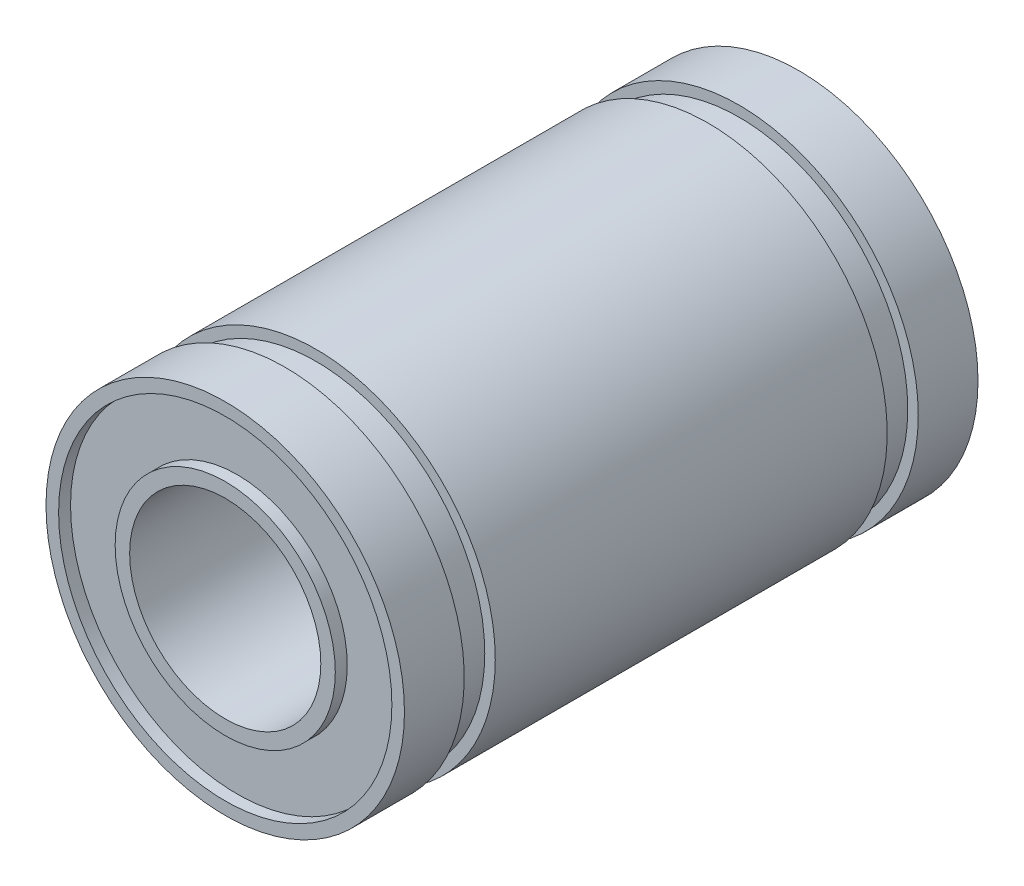
ISO-10303-21;
HEADER;
FILE_DESCRIPTION(('STEP AP214'),'2;1');
FILE_NAME('part.step','',(''),(''),'','','');
FILE_SCHEMA(('AUTOMOTIVE_DESIGN { 1 0 10303 214 1 1 1 1 }'));
ENDSEC;
DATA;
#1=APPLICATION_CONTEXT('core data for automotive mechanical design processes');
#2=APPLICATION_PROTOCOL_DEFINITION('international standard','automotive_design',2000,#1);
#3=PRODUCT_CONTEXT('',#1,'mechanical');
#4=PRODUCT('Part','Part','',(#3));
#5=PRODUCT_RELATED_PRODUCT_CATEGORY('part','',(#4));
#6=PRODUCT_DEFINITION_FORMATION('','',#4);
#7=PRODUCT_DEFINITION_CONTEXT('part definition',#1,'design');
#8=PRODUCT_DEFINITION('design','',#6,#7);
#9=PRODUCT_DEFINITION_SHAPE('','',#8);
#10=(LENGTH_UNIT() NAMED_UNIT(*) SI_UNIT(.MILLI.,.METRE.));
#11=(NAMED_UNIT(*) PLANE_ANGLE_UNIT() SI_UNIT($,.RADIAN.));
#12=(NAMED_UNIT(*) SI_UNIT($,.STERADIAN.) SOLID_ANGLE_UNIT());
#13=UNCERTAINTY_MEASURE_WITH_UNIT(LENGTH_MEASURE(1.E-05),#10,'distance_accuracy_value','');
#14=(GEOMETRIC_REPRESENTATION_CONTEXT(3) GLOBAL_UNCERTAINTY_ASSIGNED_CONTEXT((#13)) GLOBAL_UNIT_ASSIGNED_CONTEXT((#10,
#11,#12)) REPRESENTATION_CONTEXT('',''));
#15=CARTESIAN_POINT('',(0.,0.,0.));
#16=DIRECTION('',(0.,0.,1.));
#17=DIRECTION('',(1.,0.,0.));
#18=AXIS2_PLACEMENT_3D('',#15,#16,#17);
#19=CARTESIAN_POINT('',(0.,0.,12.));
#20=DIRECTION('',(0.,0.,1.));
#21=DIRECTION('',(1.,0.,0.));
#22=AXIS2_PLACEMENT_3D('',#19,#20,#21);
#23=PLANE('',#22);
#24=CARTESIAN_POINT('',(0.,0.,12.));
#25=DIRECTION('',(0.,0.,1.));
#26=DIRECTION('',(1.,0.,0.));
#27=AXIS2_PLACEMENT_3D('',#24,#25,#26);
#28=CIRCLE('',#27,4.);
#29=CARTESIAN_POINT('',(4.,0.,12.));
#30=VERTEX_POINT('',#29);
#31=EDGE_CURVE('E47',#30,#30,#28,.T.);
#32=ORIENTED_EDGE('',*,*,#31,.F.);
#33=EDGE_LOOP('',(#32));
#34=FACE_BOUND('',#33,.T.);
#35=CARTESIAN_POINT('',(0.,0.,12.));
#36=DIRECTION('',(0.,0.,-1.));
#37=DIRECTION('',(-1.,0.,0.));
#38=AXIS2_PLACEMENT_3D('',#35,#36,#37);
#39=CIRCLE('',#38,4.60638309141382);
#40=CARTESIAN_POINT('',(-4.60638309141382,0.,12.));
#41=VERTEX_POINT('',#40);
#42=EDGE_CURVE('E128',#41,#41,#39,.T.);
#43=ORIENTED_EDGE('',*,*,#42,.F.);
#44=EDGE_LOOP('',(#43));
#45=FACE_BOUND('',#44,.T.);
#46=ADVANCED_FACE('F34',(#34,#45),#23,.T.);
#47=CARTESIAN_POINT('',(0.,0.,-12.));
#48=DIRECTION('',(0.,0.,1.));
#49=DIRECTION('',(1.,0.,0.));
#50=AXIS2_PLACEMENT_3D('',#47,#48,#49);
#51=PLANE('',#50);
#52=CARTESIAN_POINT('',(0.,0.,-12.));
#53=DIRECTION('',(0.,0.,1.));
#54=DIRECTION('',(1.,0.,0.));
#55=AXIS2_PLACEMENT_3D('',#52,#53,#54);
#56=CIRCLE('',#55,4.);
#57=CARTESIAN_POINT('',(4.,0.,-12.));
#58=VERTEX_POINT('',#57);
#59=EDGE_CURVE('E50',#58,#58,#56,.T.);
#60=ORIENTED_EDGE('',*,*,#59,.T.);
#61=EDGE_LOOP('',(#60));
#62=FACE_BOUND('',#61,.T.);
#63=CARTESIAN_POINT('',(0.,0.,-12.));
#64=DIRECTION('',(0.,0.,-1.));
#65=DIRECTION('',(-1.,0.,0.));
#66=AXIS2_PLACEMENT_3D('',#63,#64,#65);
#67=CIRCLE('',#66,4.60638309141382);
#68=CARTESIAN_POINT('',(-4.60638309141382,0.,-12.));
#69=VERTEX_POINT('',#68);
#70=EDGE_CURVE('E125',#69,#69,#67,.T.);
#71=ORIENTED_EDGE('',*,*,#70,.T.);
#72=EDGE_LOOP('',(#71));
#73=FACE_BOUND('',#72,.T.);
#74=ADVANCED_FACE('F85',(#62,#73),#51,.F.);
#75=CARTESIAN_POINT('',(0.,0.,12.));
#76=DIRECTION('',(0.,0.,-1.));
#77=DIRECTION('',(-1.,0.,0.));
#78=AXIS2_PLACEMENT_3D('',#75,#76,#77);
#79=CYLINDRICAL_SURFACE('',#78,7.5);
#80=CARTESIAN_POINT('',(0.,0.,12.));
#81=DIRECTION('',(0.,0.,1.));
#82=DIRECTION('',(1.,0.,0.));
#83=AXIS2_PLACEMENT_3D('',#80,#81,#82);
#84=CIRCLE('',#83,7.5);
#85=CARTESIAN_POINT('',(7.5,0.,12.));
#86=VERTEX_POINT('',#85);
#87=EDGE_CURVE('E10',#86,#86,#84,.T.);
#88=ORIENTED_EDGE('',*,*,#87,.F.);
#89=EDGE_LOOP('',(#88));
#90=FACE_BOUND('',#89,.T.);
#91=CARTESIAN_POINT('',(0.,0.,9.5));
#92=DIRECTION('',(0.,0.,-1.));
#93=DIRECTION('',(-1.,0.,0.));
#94=AXIS2_PLACEMENT_3D('',#91,#92,#93);
#95=CIRCLE('',#94,7.5);
#96=CARTESIAN_POINT('',(-7.5,0.,9.5));
#97=VERTEX_POINT('',#96);
#98=EDGE_CURVE('E38',#97,#97,#95,.T.);
#99=ORIENTED_EDGE('',*,*,#98,.F.);
#100=EDGE_LOOP('',(#99));
#101=FACE_BOUND('',#100,.T.);
#102=ADVANCED_FACE('F36',(#90,#101),#79,.T.);
#103=CARTESIAN_POINT('',(0.,0.,-8.2));
#104=DIRECTION('',(0.,0.,-1.));
#105=DIRECTION('',(-1.,0.,0.));
#106=AXIS2_PLACEMENT_3D('',#103,#104,#105);
#107=CIRCLE('',#106,7.5);
#108=CARTESIAN_POINT('',(-7.5,0.,-8.2));
#109=VERTEX_POINT('',#108);
#110=EDGE_CURVE('E56',#109,#109,#107,.T.);
#111=ORIENTED_EDGE('',*,*,#110,.F.);
#112=EDGE_LOOP('',(#111));
#113=FACE_BOUND('',#112,.T.);
#114=CARTESIAN_POINT('',(0.,0.,8.2));
#115=DIRECTION('',(0.,0.,1.));
#116=DIRECTION('',(1.,0.,0.));
#117=AXIS2_PLACEMENT_3D('',#114,#115,#116);
#118=CIRCLE('',#117,7.5);
#119=CARTESIAN_POINT('',(7.5,0.,8.2));
#120=VERTEX_POINT('',#119);
#121=EDGE_CURVE('E59',#120,#120,#118,.T.);
#122=ORIENTED_EDGE('',*,*,#121,.F.);
#123=EDGE_LOOP('',(#122));
#124=FACE_BOUND('',#123,.T.);
#125=ADVANCED_FACE('F115',(#113,#124),#79,.T.);
#126=CARTESIAN_POINT('',(0.,0.,-12.));
#127=DIRECTION('',(0.,0.,1.));
#128=DIRECTION('',(1.,0.,0.));
#129=AXIS2_PLACEMENT_3D('',#126,#127,#128);
#130=CIRCLE('',#129,7.5);
#131=CARTESIAN_POINT('',(7.5,0.,-12.));
#132=VERTEX_POINT('',#131);
#133=EDGE_CURVE('E42',#132,#132,#130,.T.);
#134=ORIENTED_EDGE('',*,*,#133,.T.);
#135=EDGE_LOOP('',(#134));
#136=FACE_BOUND('',#135,.T.);
#137=CARTESIAN_POINT('',(0.,0.,-9.5));
#138=DIRECTION('',(0.,0.,1.));
#139=DIRECTION('',(1.,0.,0.));
#140=AXIS2_PLACEMENT_3D('',#137,#138,#139);
#141=CIRCLE('',#140,7.5);
#142=CARTESIAN_POINT('',(7.5,0.,-9.5));
#143=VERTEX_POINT('',#142);
#144=EDGE_CURVE('E53',#143,#143,#141,.T.);
#145=ORIENTED_EDGE('',*,*,#144,.F.);
#146=EDGE_LOOP('',(#145));
#147=FACE_BOUND('',#146,.T.);
#148=ADVANCED_FACE('F110',(#136,#147),#79,.T.);
#149=CARTESIAN_POINT('',(0.,0.,12.));
#150=DIRECTION('',(0.,0.,-1.));
#151=DIRECTION('',(-1.,0.,0.));
#152=AXIS2_PLACEMENT_3D('',#149,#150,#151);
#153=CIRCLE('',#152,6.97294129068912);
#154=CARTESIAN_POINT('',(-6.97294129068912,0.,12.));
#155=VERTEX_POINT('',#154);
#156=EDGE_CURVE('E119',#155,#155,#153,.T.);
#157=ORIENTED_EDGE('',*,*,#156,.T.);
#158=EDGE_LOOP('',(#157));
#159=FACE_BOUND('',#158,.T.);
#160=ORIENTED_EDGE('',*,*,#87,.T.);
#161=EDGE_LOOP('',(#160));
#162=FACE_BOUND('',#161,.T.);
#163=ADVANCED_FACE('F100',(#159,#162),#23,.T.);
#164=CARTESIAN_POINT('',(0.,0.,-12.));
#165=DIRECTION('',(0.,0.,-1.));
#166=DIRECTION('',(-1.,0.,0.));
#167=AXIS2_PLACEMENT_3D('',#164,#165,#166);
#168=CIRCLE('',#167,6.97294129068912);
#169=CARTESIAN_POINT('',(-6.97294129068912,0.,-12.));
#170=VERTEX_POINT('',#169);
#171=EDGE_CURVE('E135',#170,#170,#168,.T.);
#172=ORIENTED_EDGE('',*,*,#171,.F.);
#173=EDGE_LOOP('',(#172));
#174=FACE_BOUND('',#173,.T.);
#175=ORIENTED_EDGE('',*,*,#133,.F.);
#176=EDGE_LOOP('',(#175));
#177=FACE_BOUND('',#176,.T.);
#178=ADVANCED_FACE('F91',(#174,#177),#51,.F.);
#179=CARTESIAN_POINT('',(0.,0.,12.));
#180=DIRECTION('',(0.,0.,-1.));
#181=DIRECTION('',(-1.,0.,0.));
#182=AXIS2_PLACEMENT_3D('',#179,#180,#181);
#183=CYLINDRICAL_SURFACE('',#182,4.);
#184=ORIENTED_EDGE('',*,*,#31,.T.);
#185=EDGE_LOOP('',(#184));
#186=FACE_BOUND('',#185,.T.);
#187=ORIENTED_EDGE('',*,*,#59,.F.);
#188=EDGE_LOOP('',(#187));
#189=FACE_BOUND('',#188,.T.);
#190=ADVANCED_FACE('F88',(#186,#189),#183,.F.);
#191=CARTESIAN_POINT('',(7.99457965207147,0.,-8.2));
#192=DIRECTION('',(0.,0.,-1.));
#193=DIRECTION('',(-1.,0.,0.));
#194=AXIS2_PLACEMENT_3D('',#191,#192,#193);
#195=PLANE('',#194);
#196=CARTESIAN_POINT('',(0.,0.,-8.2));
#197=DIRECTION('',(0.,0.,-1.));
#198=DIRECTION('',(-1.,0.,0.));
#199=AXIS2_PLACEMENT_3D('',#196,#197,#198);
#200=CIRCLE('',#199,7.06045407366765);
#201=CARTESIAN_POINT('',(-7.06045407366765,0.,-8.2));
#202=VERTEX_POINT('',#201);
#203=EDGE_CURVE('E57',#202,#202,#200,.T.);
#204=ORIENTED_EDGE('',*,*,#203,.F.);
#205=EDGE_LOOP('',(#204));
#206=FACE_BOUND('',#205,.T.);
#207=ORIENTED_EDGE('',*,*,#110,.T.);
#208=EDGE_LOOP('',(#207));
#209=FACE_BOUND('',#208,.T.);
#210=ADVANCED_FACE('F90',(#206,#209),#195,.T.);
#211=CARTESIAN_POINT('',(7.99457965207147,0.,-9.5));
#212=DIRECTION('',(0.,0.,1.));
#213=DIRECTION('',(1.,0.,0.));
#214=AXIS2_PLACEMENT_3D('',#211,#212,#213);
#215=PLANE('',#214);
#216=CARTESIAN_POINT('',(0.,0.,-9.5));
#217=DIRECTION('',(0.,0.,-1.));
#218=DIRECTION('',(-1.,0.,0.));
#219=AXIS2_PLACEMENT_3D('',#216,#217,#218);
#220=CIRCLE('',#219,7.06045407366765);
#221=CARTESIAN_POINT('',(-7.06045407366765,0.,-9.5));
#222=VERTEX_POINT('',#221);
#223=EDGE_CURVE('E65',#222,#222,#220,.T.);
#224=ORIENTED_EDGE('',*,*,#223,.T.);
#225=EDGE_LOOP('',(#224));
#226=FACE_BOUND('',#225,.T.);
#227=ORIENTED_EDGE('',*,*,#144,.T.);
#228=EDGE_LOOP('',(#227));
#229=FACE_BOUND('',#228,.T.);
#230=ADVANCED_FACE('F97',(#226,#229),#215,.T.);
#231=CARTESIAN_POINT('',(0.,0.,-13.6469701227416));
#232=DIRECTION('',(0.,0.,-1.));
#233=DIRECTION('',(-1.,0.,0.));
#234=AXIS2_PLACEMENT_3D('',#231,#232,#233);
#235=CYLINDRICAL_SURFACE('',#234,7.06045407366765);
#236=ORIENTED_EDGE('',*,*,#203,.T.);
#237=EDGE_LOOP('',(#236));
#238=FACE_BOUND('',#237,.T.);
#239=ORIENTED_EDGE('',*,*,#223,.F.);
#240=EDGE_LOOP('',(#239));
#241=FACE_BOUND('',#240,.T.);
#242=ADVANCED_FACE('F149',(#238,#241),#235,.T.);
#243=CARTESIAN_POINT('',(7.99457965207147,0.,9.5));
#244=DIRECTION('',(0.,0.,-1.));
#245=DIRECTION('',(-1.,0.,0.));
#246=AXIS2_PLACEMENT_3D('',#243,#244,#245);
#247=PLANE('',#246);
#248=CARTESIAN_POINT('',(0.,0.,9.5));
#249=DIRECTION('',(0.,0.,-1.));
#250=DIRECTION('',(-1.,0.,0.));
#251=AXIS2_PLACEMENT_3D('',#248,#249,#250);
#252=CIRCLE('',#251,7.06045407366765);
#253=CARTESIAN_POINT('',(-7.06045407366765,0.,9.5));
#254=VERTEX_POINT('',#253);
#255=EDGE_CURVE('E61',#254,#254,#252,.T.);
#256=ORIENTED_EDGE('',*,*,#255,.F.);
#257=EDGE_LOOP('',(#256));
#258=FACE_BOUND('',#257,.T.);
#259=ORIENTED_EDGE('',*,*,#98,.T.);
#260=EDGE_LOOP('',(#259));
#261=FACE_BOUND('',#260,.T.);
#262=ADVANCED_FACE('F155',(#258,#261),#247,.T.);
#263=CARTESIAN_POINT('',(7.99457965207147,0.,8.2));
#264=DIRECTION('',(0.,0.,1.));
#265=DIRECTION('',(1.,0.,0.));
#266=AXIS2_PLACEMENT_3D('',#263,#264,#265);
#267=PLANE('',#266);
#268=CARTESIAN_POINT('',(0.,0.,8.2));
#269=DIRECTION('',(0.,0.,-1.));
#270=DIRECTION('',(-1.,0.,0.));
#271=AXIS2_PLACEMENT_3D('',#268,#269,#270);
#272=CIRCLE('',#271,7.06045407366765);
#273=CARTESIAN_POINT('',(-7.06045407366765,0.,8.2));
#274=VERTEX_POINT('',#273);
#275=EDGE_CURVE('E67',#274,#274,#272,.T.);
#276=ORIENTED_EDGE('',*,*,#275,.T.);
#277=EDGE_LOOP('',(#276));
#278=FACE_BOUND('',#277,.T.);
#279=ORIENTED_EDGE('',*,*,#121,.T.);
#280=EDGE_LOOP('',(#279));
#281=FACE_BOUND('',#280,.T.);
#282=ADVANCED_FACE('F161',(#278,#281),#267,.T.);
#283=CARTESIAN_POINT('',(0.,0.,-13.6469701227416));
#284=DIRECTION('',(0.,0.,-1.));
#285=DIRECTION('',(-1.,0.,0.));
#286=AXIS2_PLACEMENT_3D('',#283,#284,#285);
#287=CYLINDRICAL_SURFACE('',#286,7.06045407366765);
#288=ORIENTED_EDGE('',*,*,#255,.T.);
#289=EDGE_LOOP('',(#288));
#290=FACE_BOUND('',#289,.T.);
#291=ORIENTED_EDGE('',*,*,#275,.F.);
#292=EDGE_LOOP('',(#291));
#293=FACE_BOUND('',#292,.T.);
#294=ADVANCED_FACE('F163',(#290,#293),#287,.T.);
#295=CARTESIAN_POINT('',(0.,0.,-11.5));
#296=DIRECTION('',(0.,0.,-1.));
#297=DIRECTION('',(-1.,0.,0.));
#298=AXIS2_PLACEMENT_3D('',#295,#296,#297);
#299=CYLINDRICAL_SURFACE('',#298,6.97294129068912);
#300=CARTESIAN_POINT('',(0.,0.,-11.5));
#301=DIRECTION('',(0.,0.,-1.));
#302=DIRECTION('',(-1.,0.,0.));
#303=AXIS2_PLACEMENT_3D('',#300,#301,#302);
#304=CIRCLE('',#303,6.97294129068912);
#305=CARTESIAN_POINT('',(-6.97294129068912,0.,-11.5));
#306=VERTEX_POINT('',#305);
#307=EDGE_CURVE('E72',#306,#306,#304,.T.);
#308=ORIENTED_EDGE('',*,*,#307,.F.);
#309=EDGE_LOOP('',(#308));
#310=FACE_BOUND('',#309,.T.);
#311=ORIENTED_EDGE('',*,*,#171,.T.);
#312=EDGE_LOOP('',(#311));
#313=FACE_BOUND('',#312,.T.);
#314=ADVANCED_FACE('F142',(#310,#313),#299,.F.);
#315=CARTESIAN_POINT('',(0.,0.,-11.5));
#316=DIRECTION('',(0.,0.,-1.));
#317=DIRECTION('',(-1.,0.,0.));
#318=AXIS2_PLACEMENT_3D('',#315,#316,#317);
#319=PLANE('',#318);
#320=CARTESIAN_POINT('',(0.,0.,-11.5));
#321=DIRECTION('',(0.,0.,-1.));
#322=DIRECTION('',(-1.,0.,0.));
#323=AXIS2_PLACEMENT_3D('',#320,#321,#322);
#324=CIRCLE('',#323,4.60638309141382);
#325=CARTESIAN_POINT('',(-4.60638309141382,0.,-11.5));
#326=VERTEX_POINT('',#325);
#327=EDGE_CURVE('E132',#326,#326,#324,.T.);
#328=ORIENTED_EDGE('',*,*,#327,.F.);
#329=EDGE_LOOP('',(#328));
#330=FACE_BOUND('',#329,.T.);
#331=ORIENTED_EDGE('',*,*,#307,.T.);
#332=EDGE_LOOP('',(#331));
#333=FACE_BOUND('',#332,.T.);
#334=ADVANCED_FACE('F171',(#330,#333),#319,.T.);
#335=CARTESIAN_POINT('',(0.,0.,-11.5));
#336=DIRECTION('',(0.,0.,-1.));
#337=DIRECTION('',(-1.,0.,0.));
#338=AXIS2_PLACEMENT_3D('',#335,#336,#337);
#339=CYLINDRICAL_SURFACE('',#338,4.60638309141382);
#340=ORIENTED_EDGE('',*,*,#327,.T.);
#341=EDGE_LOOP('',(#340));
#342=FACE_BOUND('',#341,.T.);
#343=ORIENTED_EDGE('',*,*,#70,.F.);
#344=EDGE_LOOP('',(#343));
#345=FACE_BOUND('',#344,.T.);
#346=ADVANCED_FACE('F175',(#342,#345),#339,.T.);
#347=CARTESIAN_POINT('',(0.,0.,11.5));
#348=DIRECTION('',(0.,0.,1.));
#349=DIRECTION('',(-1.,0.,0.));
#350=AXIS2_PLACEMENT_3D('',#347,#348,#349);
#351=PLANE('',#350);
#352=CARTESIAN_POINT('',(0.,0.,11.5));
#353=DIRECTION('',(0.,0.,-1.));
#354=DIRECTION('',(-1.,0.,0.));
#355=AXIS2_PLACEMENT_3D('',#352,#353,#354);
#356=CIRCLE('',#355,6.97294129068912);
#357=CARTESIAN_POINT('',(-6.97294129068912,0.,11.5));
#358=VERTEX_POINT('',#357);
#359=EDGE_CURVE('E121',#358,#358,#356,.T.);
#360=ORIENTED_EDGE('',*,*,#359,.F.);
#361=EDGE_LOOP('',(#360));
#362=FACE_BOUND('',#361,.T.);
#363=CARTESIAN_POINT('',(0.,0.,11.5));
#364=DIRECTION('',(0.,0.,-1.));
#365=DIRECTION('',(-1.,0.,0.));
#366=AXIS2_PLACEMENT_3D('',#363,#364,#365);
#367=CIRCLE('',#366,4.60638309141382);
#368=CARTESIAN_POINT('',(-4.60638309141382,0.,11.5));
#369=VERTEX_POINT('',#368);
#370=EDGE_CURVE('E122',#369,#369,#367,.T.);
#371=ORIENTED_EDGE('',*,*,#370,.T.);
#372=EDGE_LOOP('',(#371));
#373=FACE_BOUND('',#372,.T.);
#374=ADVANCED_FACE('F179',(#362,#373),#351,.T.);
#375=CARTESIAN_POINT('',(0.,0.,11.5));
#376=DIRECTION('',(0.,0.,1.));
#377=DIRECTION('',(1.,0.,0.));
#378=AXIS2_PLACEMENT_3D('',#375,#376,#377);
#379=CYLINDRICAL_SURFACE('',#378,6.97294129068912);
#380=ORIENTED_EDGE('',*,*,#359,.T.);
#381=EDGE_LOOP('',(#380));
#382=FACE_BOUND('',#381,.T.);
#383=ORIENTED_EDGE('',*,*,#156,.F.);
#384=EDGE_LOOP('',(#383));
#385=FACE_BOUND('',#384,.T.);
#386=ADVANCED_FACE('F181',(#382,#385),#379,.F.);
#387=CARTESIAN_POINT('',(0.,0.,11.5));
#388=DIRECTION('',(0.,0.,1.));
#389=DIRECTION('',(1.,0.,0.));
#390=AXIS2_PLACEMENT_3D('',#387,#388,#389);
#391=CYLINDRICAL_SURFACE('',#390,4.60638309141382);
#392=ORIENTED_EDGE('',*,*,#370,.F.);
#393=EDGE_LOOP('',(#392));
#394=FACE_BOUND('',#393,.T.);
#395=ORIENTED_EDGE('',*,*,#42,.T.);
#396=EDGE_LOOP('',(#395));
#397=FACE_BOUND('',#396,.T.);
#398=ADVANCED_FACE('F184',(#394,#397),#391,.T.);
#399=CLOSED_SHELL('',(#46,#74,#102,#125,#148,#163,#178,#190,#210,#230,#242,#262,#282,#294,#314,
#334,#346,#374,#386,#398));
#400=MANIFOLD_SOLID_BREP('B2',#399);
#401=ADVANCED_BREP_SHAPE_REPRESENTATION('',(#18,#400),#14);
#402=SHAPE_DEFINITION_REPRESENTATION(#9,#401);
ENDSEC;
END-ISO-10303-21;
